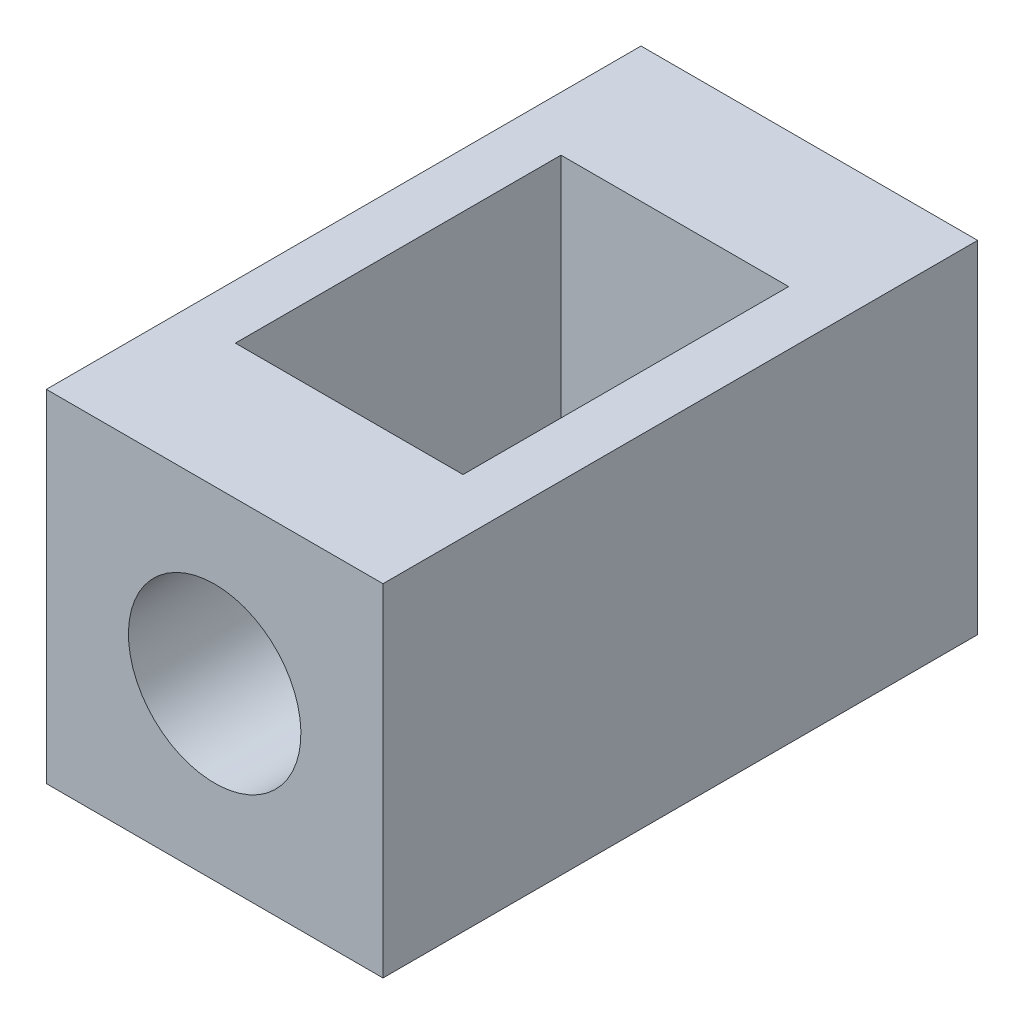
ISO-10303-21;
HEADER;
FILE_DESCRIPTION(('STEP AP214'),'2;1');
FILE_NAME('part.step','',(''),(''),'','','');
FILE_SCHEMA(('AUTOMOTIVE_DESIGN { 1 0 10303 214 1 1 1 1 }'));
ENDSEC;
DATA;
#1=APPLICATION_CONTEXT('core data for automotive mechanical design processes');
#2=APPLICATION_PROTOCOL_DEFINITION('international standard','automotive_design',2000,#1);
#3=PRODUCT_CONTEXT('',#1,'mechanical');
#4=PRODUCT('Part','Part','',(#3));
#5=PRODUCT_RELATED_PRODUCT_CATEGORY('part','',(#4));
#6=PRODUCT_DEFINITION_FORMATION('','',#4);
#7=PRODUCT_DEFINITION_CONTEXT('part definition',#1,'design');
#8=PRODUCT_DEFINITION('design','',#6,#7);
#9=PRODUCT_DEFINITION_SHAPE('','',#8);
#10=(LENGTH_UNIT() NAMED_UNIT(*) SI_UNIT(.MILLI.,.METRE.));
#11=(NAMED_UNIT(*) PLANE_ANGLE_UNIT() SI_UNIT($,.RADIAN.));
#12=(NAMED_UNIT(*) SI_UNIT($,.STERADIAN.) SOLID_ANGLE_UNIT());
#13=UNCERTAINTY_MEASURE_WITH_UNIT(LENGTH_MEASURE(1.E-05),#10,'distance_accuracy_value','');
#14=(GEOMETRIC_REPRESENTATION_CONTEXT(3) GLOBAL_UNCERTAINTY_ASSIGNED_CONTEXT((#13)) GLOBAL_UNIT_ASSIGNED_CONTEXT((#10,
#11,#12)) REPRESENTATION_CONTEXT('',''));
#15=CARTESIAN_POINT('',(0.,0.,0.));
#16=DIRECTION('',(0.,0.,1.));
#17=DIRECTION('',(1.,0.,0.));
#18=AXIS2_PLACEMENT_3D('',#15,#16,#17);
#19=CARTESIAN_POINT('',(22.8721980967912,-23.3190432182495,14.4950000000006));
#20=DIRECTION('',(0.,0.,1.));
#21=DIRECTION('',(3.01991605000675E-07,0.999999999999954,0.));
#22=AXIS2_PLACEMENT_3D('',#19,#20,#21);
#23=CYLINDRICAL_SURFACE('',#22,1.25);
#24=CARTESIAN_POINT('',(22.8721980967912,-23.3190432182488,12.5450000000006));
#25=DIRECTION('',(0.,0.,1.));
#26=DIRECTION('',(3.01991605000675E-07,0.999999999999954,0.));
#27=AXIS2_PLACEMENT_3D('',#24,#25,#26);
#28=CIRCLE('',#27,1.25);
#29=CARTESIAN_POINT('',(22.8721984742807,-22.0690432182488,12.5450000000006));
#30=VERTEX_POINT('',#29);
#31=EDGE_CURVE('E20',#30,#30,#28,.T.);
#32=ORIENTED_EDGE('',*,*,#31,.F.);
#33=EDGE_LOOP('',(#32));
#34=FACE_BOUND('',#33,.T.);
#35=CARTESIAN_POINT('',(22.8721980967912,-23.3190432182495,14.4950000000006));
#36=DIRECTION('',(0.,0.,1.));
#37=DIRECTION('',(3.01991605000675E-07,0.999999999999954,0.));
#38=AXIS2_PLACEMENT_3D('',#35,#36,#37);
#39=CIRCLE('',#38,1.25);
#40=CARTESIAN_POINT('',(22.8721984742807,-22.0690432182496,14.4950000000006));
#41=VERTEX_POINT('',#40);
#42=EDGE_CURVE('E11',#41,#41,#39,.T.);
#43=ORIENTED_EDGE('',*,*,#42,.T.);
#44=EDGE_LOOP('',(#43));
#45=FACE_BOUND('',#44,.T.);
#46=ADVANCED_FACE('F17',(#34,#45),#23,.F.);
#47=CARTESIAN_POINT('',(25.3121973493622,-25.7940439551085,14.4950000000007));
#48=DIRECTION('',(-0.999999999999954,3.01991605000676E-07,0.));
#49=DIRECTION('',(3.01991605000675E-07,0.999999999999954,0.));
#50=AXIS2_PLACEMENT_3D('',#47,#48,#49);
#51=PLANE('',#50);
#52=DIRECTION('',(0.,0.,1.));
#53=VECTOR('',#52,1.);
#54=CARTESIAN_POINT('',(25.3121988442202,-20.8440439551085,14.4950000000006));
#55=LINE('',#54,#53);
#56=CARTESIAN_POINT('',(25.3121988442202,-20.8440439551088,5.87500000000066));
#57=VERTEX_POINT('',#56);
#58=CARTESIAN_POINT('',(25.3121988442202,-20.8440439551085,14.4950000000006));
#59=VERTEX_POINT('',#58);
#60=EDGE_CURVE('E171',#57,#59,#55,.T.);
#61=ORIENTED_EDGE('',*,*,#60,.T.);
#62=DIRECTION('',(3.01991605000675E-07,0.999999999999954,0.));
#63=VECTOR('',#62,1.);
#64=CARTESIAN_POINT('',(25.3121973493622,-25.7940439551085,14.4950000000007));
#65=LINE('',#64,#63);
#66=CARTESIAN_POINT('',(25.3121973493622,-25.7940439551085,14.4950000000007));
#67=VERTEX_POINT('',#66);
#68=EDGE_CURVE('E27',#67,#59,#65,.T.);
#69=ORIENTED_EDGE('',*,*,#68,.F.);
#70=DIRECTION('',(0.,0.,1.));
#71=VECTOR('',#70,1.);
#72=CARTESIAN_POINT('',(25.3121973493622,-25.7940439551085,14.4950000000007));
#73=LINE('',#72,#71);
#74=CARTESIAN_POINT('',(25.3121973493622,-25.7940439551084,5.87500000000063));
#75=VERTEX_POINT('',#74);
#76=EDGE_CURVE('E224',#75,#67,#73,.T.);
#77=ORIENTED_EDGE('',*,*,#76,.F.);
#78=DIRECTION('',(3.01991605000675E-07,0.999999999999954,0.));
#79=VECTOR('',#78,1.);
#80=CARTESIAN_POINT('',(25.3121973493622,-25.7940439551084,5.87500000000063));
#81=LINE('',#80,#79);
#82=EDGE_CURVE('E73',#75,#57,#81,.T.);
#83=ORIENTED_EDGE('',*,*,#82,.T.);
#84=EDGE_LOOP('',(#61,#69,#77,#83));
#85=FACE_BOUND('',#84,.T.);
#86=ADVANCED_FACE('F282',(#85),#51,.F.);
#87=CARTESIAN_POINT('',(20.4321973493622,-25.7940424813894,14.4950000000006));
#88=DIRECTION('',(0.,0.,-1.));
#89=DIRECTION('',(0.999999999999954,-3.01991605000676E-07,0.));
#90=AXIS2_PLACEMENT_3D('',#87,#88,#89);
#91=PLANE('',#90);
#92=ORIENTED_EDGE('',*,*,#42,.F.);
#93=EDGE_LOOP('',(#92));
#94=FACE_BOUND('',#93,.T.);
#95=DIRECTION('',(-0.999999999999954,3.01991605000676E-07,0.));
#96=VECTOR('',#95,1.);
#97=CARTESIAN_POINT('',(20.4321988442202,-20.8440424813895,14.4950000000006));
#98=LINE('',#97,#96);
#99=CARTESIAN_POINT('',(20.4321988442202,-20.8440424813895,14.4950000000006));
#100=VERTEX_POINT('',#99);
#101=EDGE_CURVE('E208',#59,#100,#98,.T.);
#102=ORIENTED_EDGE('',*,*,#101,.T.);
#103=DIRECTION('',(3.01991605000675E-07,0.999999999999954,0.));
#104=VECTOR('',#103,1.);
#105=CARTESIAN_POINT('',(20.4321973493622,-25.7940424813894,14.4950000000006));
#106=LINE('',#105,#104);
#107=CARTESIAN_POINT('',(20.4321973493622,-25.7940424813894,14.4950000000006));
#108=VERTEX_POINT('',#107);
#109=EDGE_CURVE('E213',#108,#100,#106,.T.);
#110=ORIENTED_EDGE('',*,*,#109,.F.);
#111=DIRECTION('',(-0.999999999999954,3.01991605000676E-07,0.));
#112=VECTOR('',#111,1.);
#113=CARTESIAN_POINT('',(20.4321973493622,-25.7940424813894,14.4950000000006));
#114=LINE('',#113,#112);
#115=EDGE_CURVE('E219',#67,#108,#114,.T.);
#116=ORIENTED_EDGE('',*,*,#115,.F.);
#117=ORIENTED_EDGE('',*,*,#68,.T.);
#118=EDGE_LOOP('',(#102,#110,#116,#117));
#119=FACE_BOUND('',#118,.T.);
#120=ADVANCED_FACE('F285',(#94,#119),#91,.F.);
#121=CARTESIAN_POINT('',(20.4321973493622,-25.7940424813894,14.4950000000006));
#122=DIRECTION('',(0.999999999999954,-3.01991605000676E-07,0.));
#123=DIRECTION('',(-3.01991605000675E-07,-0.999999999999954,0.));
#124=AXIS2_PLACEMENT_3D('',#121,#122,#123);
#125=PLANE('',#124);
#126=DIRECTION('',(0.,0.,-1.));
#127=VECTOR('',#126,1.);
#128=CARTESIAN_POINT('',(20.4321988442202,-20.8440424813895,14.4950000000006));
#129=LINE('',#128,#127);
#130=CARTESIAN_POINT('',(20.4321988442202,-20.8440424813898,5.8750000000006));
#131=VERTEX_POINT('',#130);
#132=EDGE_CURVE('E196',#100,#131,#129,.T.);
#133=ORIENTED_EDGE('',*,*,#132,.T.);
#134=DIRECTION('',(3.01991605000675E-07,0.999999999999954,0.));
#135=VECTOR('',#134,1.);
#136=CARTESIAN_POINT('',(20.4321973493622,-25.7940424813894,5.87500000000057));
#137=LINE('',#136,#135);
#138=CARTESIAN_POINT('',(20.4321973493622,-25.7940424813894,5.87500000000057));
#139=VERTEX_POINT('',#138);
#140=EDGE_CURVE('E39',#139,#131,#137,.T.);
#141=ORIENTED_EDGE('',*,*,#140,.F.);
#142=DIRECTION('',(0.,0.,-1.));
#143=VECTOR('',#142,1.);
#144=CARTESIAN_POINT('',(20.4321973493622,-25.7940424813894,14.4950000000006));
#145=LINE('',#144,#143);
#146=EDGE_CURVE('E203',#108,#139,#145,.T.);
#147=ORIENTED_EDGE('',*,*,#146,.F.);
#148=ORIENTED_EDGE('',*,*,#109,.T.);
#149=EDGE_LOOP('',(#133,#141,#147,#148));
#150=FACE_BOUND('',#149,.T.);
#151=ADVANCED_FACE('F287',(#150),#125,.F.);
#152=CARTESIAN_POINT('',(20.4321973493622,-25.7940424813894,5.87500000000057));
#153=DIRECTION('',(0.,0.,1.));
#154=DIRECTION('',(-0.999999999999954,3.01991605000676E-07,0.));
#155=AXIS2_PLACEMENT_3D('',#152,#153,#154);
#156=PLANE('',#155);
#157=DIRECTION('',(0.999999999999954,-3.01991605000676E-07,0.));
#158=VECTOR('',#157,1.);
#159=CARTESIAN_POINT('',(20.4321988442202,-20.8440424813898,5.8750000000006));
#160=LINE('',#159,#158);
#161=EDGE_CURVE('E193',#131,#57,#160,.T.);
#162=ORIENTED_EDGE('',*,*,#161,.T.);
#163=ORIENTED_EDGE('',*,*,#82,.F.);
#164=DIRECTION('',(0.999999999999954,-3.01991605000676E-07,0.));
#165=VECTOR('',#164,1.);
#166=CARTESIAN_POINT('',(20.4321973493622,-25.7940424813894,5.87500000000057));
#167=LINE('',#166,#165);
#168=EDGE_CURVE('E199',#139,#75,#167,.T.);
#169=ORIENTED_EDGE('',*,*,#168,.F.);
#170=ORIENTED_EDGE('',*,*,#140,.T.);
#171=EDGE_LOOP('',(#162,#163,#169,#170));
#172=FACE_BOUND('',#171,.T.);
#173=ADVANCED_FACE('F303',(#172),#156,.F.);
#174=CARTESIAN_POINT('',(22.8721973493622,-25.7940432182489,10.1850000000006));
#175=DIRECTION('',(-3.01991605000675E-07,-0.999999999999954,0.));
#176=DIRECTION('',(-0.999999999999954,3.01991605000676E-07,0.));
#177=AXIS2_PLACEMENT_3D('',#174,#175,#176);
#178=PLANE('',#177);
#179=DIRECTION('',(0.,0.,1.));
#180=VECTOR('',#179,1.);
#181=CARTESIAN_POINT('',(24.5221973493612,-25.7940437165351,10.1850000000006));
#182=LINE('',#181,#180);
#183=CARTESIAN_POINT('',(24.5221973493622,-25.7940437165351,7.82500000000062));
#184=VERTEX_POINT('',#183);
#185=CARTESIAN_POINT('',(24.5221973493612,-25.7940437165351,12.5450000000006));
#186=VERTEX_POINT('',#185);
#187=EDGE_CURVE('E166',#184,#186,#182,.T.);
#188=ORIENTED_EDGE('',*,*,#187,.F.);
#189=DIRECTION('',(0.999999999999954,-3.01991605000676E-07,0.));
#190=VECTOR('',#189,1.);
#191=CARTESIAN_POINT('',(22.8721973493622,-25.7940432182488,7.8250000000006));
#192=LINE('',#191,#190);
#193=CARTESIAN_POINT('',(21.2221973493622,-25.7940427199627,7.82500000000058));
#194=VERTEX_POINT('',#193);
#195=EDGE_CURVE('E127',#194,#184,#192,.T.);
#196=ORIENTED_EDGE('',*,*,#195,.F.);
#197=DIRECTION('',(0.,0.,-1.));
#198=VECTOR('',#197,1.);
#199=CARTESIAN_POINT('',(21.2221973493622,-25.7940427199627,10.1850000000006));
#200=LINE('',#199,#198);
#201=CARTESIAN_POINT('',(21.2221973493622,-25.7940427199627,12.5450000000006));
#202=VERTEX_POINT('',#201);
#203=EDGE_CURVE('E151',#202,#194,#200,.T.);
#204=ORIENTED_EDGE('',*,*,#203,.F.);
#205=DIRECTION('',(-0.999999999999954,3.01991605000676E-07,0.));
#206=VECTOR('',#205,1.);
#207=CARTESIAN_POINT('',(22.8721973493622,-25.7940432182489,12.5450000000006));
#208=LINE('',#207,#206);
#209=EDGE_CURVE('E140',#186,#202,#208,.T.);
#210=ORIENTED_EDGE('',*,*,#209,.F.);
#211=EDGE_LOOP('',(#188,#196,#204,#210));
#212=FACE_BOUND('',#211,.T.);
#213=ORIENTED_EDGE('',*,*,#76,.T.);
#214=ORIENTED_EDGE('',*,*,#115,.T.);
#215=ORIENTED_EDGE('',*,*,#146,.T.);
#216=ORIENTED_EDGE('',*,*,#168,.T.);
#217=EDGE_LOOP('',(#213,#214,#215,#216));
#218=FACE_BOUND('',#217,.T.);
#219=ADVANCED_FACE('F293',(#212,#218),#178,.T.);
#220=CARTESIAN_POINT('',(22.8721988442202,-20.8440432182497,10.1850000000006));
#221=DIRECTION('',(-3.01991605000675E-07,-0.999999999999954,0.));
#222=DIRECTION('',(-0.999999999999954,3.01991605000676E-07,0.));
#223=AXIS2_PLACEMENT_3D('',#220,#221,#222);
#224=PLANE('',#223);
#225=DIRECTION('',(0.999999999999954,-3.01991605000676E-07,0.));
#226=VECTOR('',#225,1.);
#227=CARTESIAN_POINT('',(21.2221988442212,-20.8440427199626,7.82500000000061));
#228=LINE('',#227,#226);
#229=CARTESIAN_POINT('',(21.2221988442212,-20.8440427199626,7.82500000000061));
#230=VERTEX_POINT('',#229);
#231=CARTESIAN_POINT('',(24.5221988442202,-20.8440437165355,7.82500000000065));
#232=VERTEX_POINT('',#231);
#233=EDGE_CURVE('E161',#230,#232,#228,.T.);
#234=ORIENTED_EDGE('',*,*,#233,.T.);
#235=DIRECTION('',(0.,0.,1.));
#236=VECTOR('',#235,1.);
#237=CARTESIAN_POINT('',(24.5221988442202,-20.8440437165358,12.5450000000006));
#238=LINE('',#237,#236);
#239=CARTESIAN_POINT('',(24.5221988442202,-20.8440437165358,12.5450000000006));
#240=VERTEX_POINT('',#239);
#241=EDGE_CURVE('E84',#232,#240,#238,.T.);
#242=ORIENTED_EDGE('',*,*,#241,.T.);
#243=DIRECTION('',(-0.999999999999954,3.01991605000676E-07,0.));
#244=VECTOR('',#243,1.);
#245=CARTESIAN_POINT('',(21.2221988442212,-20.8440427199627,12.5450000000006));
#246=LINE('',#245,#244);
#247=CARTESIAN_POINT('',(21.2221988442212,-20.8440427199627,12.5450000000006));
#248=VERTEX_POINT('',#247);
#249=EDGE_CURVE('E130',#240,#248,#246,.T.);
#250=ORIENTED_EDGE('',*,*,#249,.T.);
#251=DIRECTION('',(0.,0.,-1.));
#252=VECTOR('',#251,1.);
#253=CARTESIAN_POINT('',(21.2221988442212,-20.8440427199627,12.5450000000006));
#254=LINE('',#253,#252);
#255=EDGE_CURVE('E116',#248,#230,#254,.T.);
#256=ORIENTED_EDGE('',*,*,#255,.T.);
#257=EDGE_LOOP('',(#234,#242,#250,#256));
#258=FACE_BOUND('',#257,.T.);
#259=ORIENTED_EDGE('',*,*,#60,.F.);
#260=ORIENTED_EDGE('',*,*,#161,.F.);
#261=ORIENTED_EDGE('',*,*,#132,.F.);
#262=ORIENTED_EDGE('',*,*,#101,.F.);
#263=EDGE_LOOP('',(#259,#260,#261,#262));
#264=FACE_BOUND('',#263,.T.);
#265=ADVANCED_FACE('F131',(#258,#264),#224,.F.);
#266=CARTESIAN_POINT('',(24.5221988442202,-20.8440437165358,12.5450000000006));
#267=DIRECTION('',(0.999999999999954,-3.01991605000676E-07,0.));
#268=DIRECTION('',(-3.01991605000675E-07,-0.999999999999954,0.));
#269=AXIS2_PLACEMENT_3D('',#266,#267,#268);
#270=PLANE('',#269);
#271=ORIENTED_EDGE('',*,*,#187,.T.);
#272=DIRECTION('',(-3.01991605000675E-07,-0.999999999999954,0.));
#273=VECTOR('',#272,1.);
#274=CARTESIAN_POINT('',(24.5221988442202,-20.8440437165358,12.5450000000006));
#275=LINE('',#274,#273);
#276=EDGE_CURVE('E136',#240,#186,#275,.T.);
#277=ORIENTED_EDGE('',*,*,#276,.F.);
#278=ORIENTED_EDGE('',*,*,#241,.F.);
#279=DIRECTION('',(-3.01991605000675E-07,-0.999999999999954,0.));
#280=VECTOR('',#279,1.);
#281=CARTESIAN_POINT('',(24.5221988442202,-20.8440437165355,7.82500000000065));
#282=LINE('',#281,#280);
#283=EDGE_CURVE('E158',#232,#184,#282,.T.);
#284=ORIENTED_EDGE('',*,*,#283,.T.);
#285=EDGE_LOOP('',(#271,#277,#278,#284));
#286=FACE_BOUND('',#285,.T.);
#287=ADVANCED_FACE('F312',(#286),#270,.F.);
#288=CARTESIAN_POINT('',(21.2221988442212,-20.8440427199626,7.82500000000061));
#289=DIRECTION('',(0.,0.,-1.));
#290=DIRECTION('',(-3.01991605000675E-07,-0.999999999999954,0.));
#291=AXIS2_PLACEMENT_3D('',#288,#289,#290);
#292=PLANE('',#291);
#293=ORIENTED_EDGE('',*,*,#195,.T.);
#294=ORIENTED_EDGE('',*,*,#283,.F.);
#295=ORIENTED_EDGE('',*,*,#233,.F.);
#296=DIRECTION('',(-3.01991605000675E-07,-0.999999999999954,0.));
#297=VECTOR('',#296,1.);
#298=CARTESIAN_POINT('',(21.2221988442212,-20.8440427199626,7.82500000000061));
#299=LINE('',#298,#297);
#300=EDGE_CURVE('E124',#230,#194,#299,.T.);
#301=ORIENTED_EDGE('',*,*,#300,.T.);
#302=EDGE_LOOP('',(#293,#294,#295,#301));
#303=FACE_BOUND('',#302,.T.);
#304=ADVANCED_FACE('F315',(#303),#292,.F.);
#305=CARTESIAN_POINT('',(21.2221988442212,-20.8440427199627,12.5450000000006));
#306=DIRECTION('',(-0.999999999999954,3.01991605000676E-07,0.));
#307=DIRECTION('',(3.01991605000675E-07,0.999999999999954,0.));
#308=AXIS2_PLACEMENT_3D('',#305,#306,#307);
#309=PLANE('',#308);
#310=ORIENTED_EDGE('',*,*,#203,.T.);
#311=ORIENTED_EDGE('',*,*,#300,.F.);
#312=ORIENTED_EDGE('',*,*,#255,.F.);
#313=DIRECTION('',(-3.01991605000675E-07,-0.999999999999954,0.));
#314=VECTOR('',#313,1.);
#315=CARTESIAN_POINT('',(21.2221988442212,-20.8440427199627,12.5450000000006));
#316=LINE('',#315,#314);
#317=EDGE_CURVE('E121',#248,#202,#316,.T.);
#318=ORIENTED_EDGE('',*,*,#317,.T.);
#319=EDGE_LOOP('',(#310,#311,#312,#318));
#320=FACE_BOUND('',#319,.T.);
#321=ADVANCED_FACE('F119',(#320),#309,.F.);
#322=CARTESIAN_POINT('',(21.2221988442212,-20.8440427199627,12.5450000000006));
#323=DIRECTION('',(0.,0.,1.));
#324=DIRECTION('',(3.01991605000675E-07,0.999999999999954,0.));
#325=AXIS2_PLACEMENT_3D('',#322,#323,#324);
#326=PLANE('',#325);
#327=ORIENTED_EDGE('',*,*,#31,.T.);
#328=EDGE_LOOP('',(#327));
#329=FACE_BOUND('',#328,.T.);
#330=ORIENTED_EDGE('',*,*,#209,.T.);
#331=ORIENTED_EDGE('',*,*,#317,.F.);
#332=ORIENTED_EDGE('',*,*,#249,.F.);
#333=ORIENTED_EDGE('',*,*,#276,.T.);
#334=EDGE_LOOP('',(#330,#331,#332,#333));
#335=FACE_BOUND('',#334,.T.);
#336=ADVANCED_FACE('F138',(#329,#335),#326,.F.);
#337=CLOSED_SHELL('',(#46,#86,#120,#151,#173,#219,#265,#287,#304,#321,#336));
#338=MANIFOLD_SOLID_BREP('B1',#337);
#339=ADVANCED_BREP_SHAPE_REPRESENTATION('',(#18,#338),#14);
#340=SHAPE_DEFINITION_REPRESENTATION(#9,#339);
ENDSEC;
END-ISO-10303-21;
